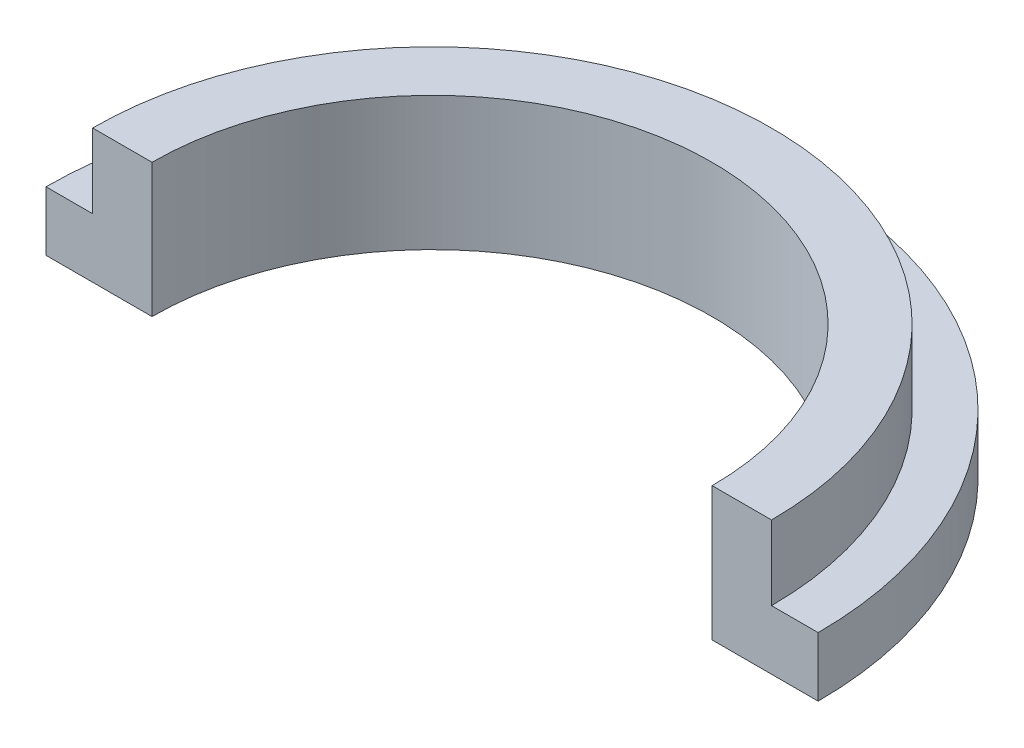
ISO-10303-21;
HEADER;
FILE_DESCRIPTION(('STEP AP214'),'2;1');
FILE_NAME('part.step','',(''),(''),'','','');
FILE_SCHEMA(('AUTOMOTIVE_DESIGN { 1 0 10303 214 1 1 1 1 }'));
ENDSEC;
DATA;
#1=APPLICATION_CONTEXT('core data for automotive mechanical design processes');
#2=APPLICATION_PROTOCOL_DEFINITION('international standard','automotive_design',2000,#1);
#3=PRODUCT_CONTEXT('',#1,'mechanical');
#4=PRODUCT('Part','Part','',(#3));
#5=PRODUCT_RELATED_PRODUCT_CATEGORY('part','',(#4));
#6=PRODUCT_DEFINITION_FORMATION('','',#4);
#7=PRODUCT_DEFINITION_CONTEXT('part definition',#1,'design');
#8=PRODUCT_DEFINITION('design','',#6,#7);
#9=PRODUCT_DEFINITION_SHAPE('','',#8);
#10=(LENGTH_UNIT() NAMED_UNIT(*) SI_UNIT(.MILLI.,.METRE.));
#11=(NAMED_UNIT(*) PLANE_ANGLE_UNIT() SI_UNIT($,.RADIAN.));
#12=(NAMED_UNIT(*) SI_UNIT($,.STERADIAN.) SOLID_ANGLE_UNIT());
#13=UNCERTAINTY_MEASURE_WITH_UNIT(LENGTH_MEASURE(1.E-05),#10,'distance_accuracy_value','');
#14=(GEOMETRIC_REPRESENTATION_CONTEXT(3) GLOBAL_UNCERTAINTY_ASSIGNED_CONTEXT((#13)) GLOBAL_UNIT_ASSIGNED_CONTEXT((#10,
#11,#12)) REPRESENTATION_CONTEXT('',''));
#15=CARTESIAN_POINT('',(0.,0.,0.));
#16=DIRECTION('',(0.,0.,1.));
#17=DIRECTION('',(1.,0.,0.));
#18=AXIS2_PLACEMENT_3D('',#15,#16,#17);
#19=CARTESIAN_POINT('',(0.,4.5,0.));
#20=DIRECTION('',(0.,-1.,0.));
#21=DIRECTION('',(0.,0.,-1.));
#22=AXIS2_PLACEMENT_3D('',#19,#20,#21);
#23=CYLINDRICAL_SURFACE('',#22,13.);
#24=CARTESIAN_POINT('',(0.,2.,0.));
#25=DIRECTION('',(0.,1.,0.));
#26=DIRECTION('',(0.,0.,1.));
#27=AXIS2_PLACEMENT_3D('',#24,#25,#26);
#28=CIRCLE('',#27,13.);
#29=CARTESIAN_POINT('',(13.,2.,0.));
#30=VERTEX_POINT('',#29);
#31=CARTESIAN_POINT('',(-13.,2.,0.));
#32=VERTEX_POINT('',#31);
#33=EDGE_CURVE('E126',#30,#32,#28,.T.);
#34=ORIENTED_EDGE('',*,*,#33,.F.);
#35=DIRECTION('',(0.,-1.,0.));
#36=VECTOR('',#35,1.);
#37=CARTESIAN_POINT('',(13.,4.5,0.));
#38=LINE('',#37,#36);
#39=CARTESIAN_POINT('',(13.,0.,0.));
#40=VERTEX_POINT('',#39);
#41=EDGE_CURVE('E48',#30,#40,#38,.T.);
#42=ORIENTED_EDGE('',*,*,#41,.T.);
#43=CARTESIAN_POINT('',(0.,0.,0.));
#44=DIRECTION('',(0.,1.,0.));
#45=DIRECTION('',(0.,0.,1.));
#46=AXIS2_PLACEMENT_3D('',#43,#44,#45);
#47=CIRCLE('',#46,13.);
#48=CARTESIAN_POINT('',(-13.,0.,0.));
#49=VERTEX_POINT('',#48);
#50=EDGE_CURVE('E96',#40,#49,#47,.T.);
#51=ORIENTED_EDGE('',*,*,#50,.T.);
#52=DIRECTION('',(0.,-1.,0.));
#53=VECTOR('',#52,1.);
#54=CARTESIAN_POINT('',(-13.,4.5,0.));
#55=LINE('',#54,#53);
#56=EDGE_CURVE('E89',#32,#49,#55,.T.);
#57=ORIENTED_EDGE('',*,*,#56,.F.);
#58=EDGE_LOOP('',(#34,#42,#51,#57));
#59=FACE_BOUND('',#58,.T.);
#60=ADVANCED_FACE('F39',(#59),#23,.T.);
#61=CARTESIAN_POINT('',(0.,4.5,0.));
#62=DIRECTION('',(0.,-1.,0.));
#63=DIRECTION('',(0.,0.,-1.));
#64=AXIS2_PLACEMENT_3D('',#61,#62,#63);
#65=CYLINDRICAL_SURFACE('',#64,9.43);
#66=CARTESIAN_POINT('',(0.,0.,0.));
#67=DIRECTION('',(0.,-1.,0.));
#68=DIRECTION('',(0.,0.,1.));
#69=AXIS2_PLACEMENT_3D('',#66,#67,#68);
#70=CIRCLE('',#69,9.43);
#71=CARTESIAN_POINT('',(-9.43,0.,0.));
#72=VERTEX_POINT('',#71);
#73=CARTESIAN_POINT('',(9.43,0.,0.));
#74=VERTEX_POINT('',#73);
#75=EDGE_CURVE('E101',#72,#74,#70,.T.);
#76=ORIENTED_EDGE('',*,*,#75,.T.);
#77=DIRECTION('',(0.,-1.,0.));
#78=VECTOR('',#77,1.);
#79=CARTESIAN_POINT('',(9.43,4.5,0.));
#80=LINE('',#79,#78);
#81=CARTESIAN_POINT('',(9.43,4.5,0.));
#82=VERTEX_POINT('',#81);
#83=EDGE_CURVE('E11',#82,#74,#80,.T.);
#84=ORIENTED_EDGE('',*,*,#83,.F.);
#85=CARTESIAN_POINT('',(0.,4.5,0.));
#86=DIRECTION('',(0.,-1.,0.));
#87=DIRECTION('',(0.,0.,1.));
#88=AXIS2_PLACEMENT_3D('',#85,#86,#87);
#89=CIRCLE('',#88,9.43);
#90=CARTESIAN_POINT('',(-9.43,4.5,0.));
#91=VERTEX_POINT('',#90);
#92=EDGE_CURVE('E95',#91,#82,#89,.T.);
#93=ORIENTED_EDGE('',*,*,#92,.F.);
#94=DIRECTION('',(0.,-1.,0.));
#95=VECTOR('',#94,1.);
#96=CARTESIAN_POINT('',(-9.43,4.5,0.));
#97=LINE('',#96,#95);
#98=EDGE_CURVE('E85',#91,#72,#97,.T.);
#99=ORIENTED_EDGE('',*,*,#98,.T.);
#100=EDGE_LOOP('',(#76,#84,#93,#99));
#101=FACE_BOUND('',#100,.T.);
#102=ADVANCED_FACE('F41',(#101),#65,.F.);
#103=CARTESIAN_POINT('',(9.43,4.5,0.));
#104=DIRECTION('',(0.,0.,-1.));
#105=DIRECTION('',(-1.,0.,0.));
#106=AXIS2_PLACEMENT_3D('',#103,#104,#105);
#107=PLANE('',#106);
#108=DIRECTION('',(1.,0.,0.));
#109=VECTOR('',#108,1.);
#110=CARTESIAN_POINT('',(11.43,2.,0.));
#111=LINE('',#110,#109);
#112=CARTESIAN_POINT('',(11.43,2.,0.));
#113=VERTEX_POINT('',#112);
#114=EDGE_CURVE('E140',#113,#30,#111,.T.);
#115=ORIENTED_EDGE('',*,*,#114,.F.);
#116=DIRECTION('',(0.,1.,0.));
#117=VECTOR('',#116,1.);
#118=CARTESIAN_POINT('',(11.43,2.,0.));
#119=LINE('',#118,#117);
#120=CARTESIAN_POINT('',(11.43,4.5,0.));
#121=VERTEX_POINT('',#120);
#122=EDGE_CURVE('E108',#113,#121,#119,.T.);
#123=ORIENTED_EDGE('',*,*,#122,.T.);
#124=DIRECTION('',(1.,0.,0.));
#125=VECTOR('',#124,1.);
#126=CARTESIAN_POINT('',(9.43,4.5,0.));
#127=LINE('',#126,#125);
#128=EDGE_CURVE('E131',#82,#121,#127,.T.);
#129=ORIENTED_EDGE('',*,*,#128,.F.);
#130=ORIENTED_EDGE('',*,*,#83,.T.);
#131=DIRECTION('',(1.,0.,0.));
#132=VECTOR('',#131,1.);
#133=CARTESIAN_POINT('',(9.43,0.,0.));
#134=LINE('',#133,#132);
#135=EDGE_CURVE('E106',#74,#40,#134,.T.);
#136=ORIENTED_EDGE('',*,*,#135,.T.);
#137=ORIENTED_EDGE('',*,*,#41,.F.);
#138=EDGE_LOOP('',(#115,#123,#129,#130,#136,#137));
#139=FACE_BOUND('',#138,.T.);
#140=ADVANCED_FACE('F129',(#139),#107,.F.);
#141=CARTESIAN_POINT('',(-13.,4.5,0.));
#142=DIRECTION('',(0.,0.,-1.));
#143=DIRECTION('',(-1.,0.,0.));
#144=AXIS2_PLACEMENT_3D('',#141,#142,#143);
#145=PLANE('',#144);
#146=DIRECTION('',(1.,0.,0.));
#147=VECTOR('',#146,1.);
#148=CARTESIAN_POINT('',(-13.,4.5,0.));
#149=LINE('',#148,#147);
#150=CARTESIAN_POINT('',(-11.43,4.5,0.));
#151=VERTEX_POINT('',#150);
#152=EDGE_CURVE('E63',#151,#91,#149,.T.);
#153=ORIENTED_EDGE('',*,*,#152,.F.);
#154=DIRECTION('',(0.,1.,0.));
#155=VECTOR('',#154,1.);
#156=CARTESIAN_POINT('',(-11.43,2.,0.));
#157=LINE('',#156,#155);
#158=CARTESIAN_POINT('',(-11.43,2.,0.));
#159=VERTEX_POINT('',#158);
#160=EDGE_CURVE('E55',#159,#151,#157,.T.);
#161=ORIENTED_EDGE('',*,*,#160,.F.);
#162=DIRECTION('',(1.,0.,0.));
#163=VECTOR('',#162,1.);
#164=CARTESIAN_POINT('',(-13.,2.,0.));
#165=LINE('',#164,#163);
#166=EDGE_CURVE('E152',#32,#159,#165,.T.);
#167=ORIENTED_EDGE('',*,*,#166,.F.);
#168=ORIENTED_EDGE('',*,*,#56,.T.);
#169=DIRECTION('',(1.,0.,0.));
#170=VECTOR('',#169,1.);
#171=CARTESIAN_POINT('',(-13.,0.,0.));
#172=LINE('',#171,#170);
#173=EDGE_CURVE('E82',#49,#72,#172,.T.);
#174=ORIENTED_EDGE('',*,*,#173,.T.);
#175=ORIENTED_EDGE('',*,*,#98,.F.);
#176=EDGE_LOOP('',(#153,#161,#167,#168,#174,#175));
#177=FACE_BOUND('',#176,.T.);
#178=ADVANCED_FACE('F84',(#177),#145,.F.);
#179=CARTESIAN_POINT('',(0.,4.5,0.));
#180=DIRECTION('',(0.,1.,0.));
#181=DIRECTION('',(0.,0.,1.));
#182=AXIS2_PLACEMENT_3D('',#179,#180,#181);
#183=PLANE('',#182);
#184=CARTESIAN_POINT('',(0.,4.5,0.));
#185=DIRECTION('',(0.,-1.,0.));
#186=DIRECTION('',(0.,0.,1.));
#187=AXIS2_PLACEMENT_3D('',#184,#185,#186);
#188=CIRCLE('',#187,11.43);
#189=EDGE_CURVE('E142',#151,#121,#188,.T.);
#190=ORIENTED_EDGE('',*,*,#189,.F.);
#191=ORIENTED_EDGE('',*,*,#152,.T.);
#192=ORIENTED_EDGE('',*,*,#92,.T.);
#193=ORIENTED_EDGE('',*,*,#128,.T.);
#194=EDGE_LOOP('',(#190,#191,#192,#193));
#195=FACE_BOUND('',#194,.T.);
#196=ADVANCED_FACE('F135',(#195),#183,.T.);
#197=CARTESIAN_POINT('',(0.,0.,0.));
#198=DIRECTION('',(0.,1.,0.));
#199=DIRECTION('',(0.,0.,1.));
#200=AXIS2_PLACEMENT_3D('',#197,#198,#199);
#201=PLANE('',#200);
#202=ORIENTED_EDGE('',*,*,#75,.F.);
#203=ORIENTED_EDGE('',*,*,#173,.F.);
#204=ORIENTED_EDGE('',*,*,#50,.F.);
#205=ORIENTED_EDGE('',*,*,#135,.F.);
#206=EDGE_LOOP('',(#202,#203,#204,#205));
#207=FACE_BOUND('',#206,.T.);
#208=ADVANCED_FACE('F104',(#207),#201,.F.);
#209=CARTESIAN_POINT('',(0.,2.,0.));
#210=DIRECTION('',(0.,1.,0.));
#211=DIRECTION('',(0.,0.,1.));
#212=AXIS2_PLACEMENT_3D('',#209,#210,#211);
#213=CYLINDRICAL_SURFACE('',#212,11.43);
#214=ORIENTED_EDGE('',*,*,#189,.T.);
#215=ORIENTED_EDGE('',*,*,#122,.F.);
#216=CARTESIAN_POINT('',(0.,2.,0.));
#217=DIRECTION('',(0.,-1.,0.));
#218=DIRECTION('',(0.,0.,1.));
#219=AXIS2_PLACEMENT_3D('',#216,#217,#218);
#220=CIRCLE('',#219,11.43);
#221=EDGE_CURVE('E148',#159,#113,#220,.T.);
#222=ORIENTED_EDGE('',*,*,#221,.F.);
#223=ORIENTED_EDGE('',*,*,#160,.T.);
#224=EDGE_LOOP('',(#214,#215,#222,#223));
#225=FACE_BOUND('',#224,.T.);
#226=ADVANCED_FACE('F166',(#225),#213,.T.);
#227=CARTESIAN_POINT('',(0.,2.,0.));
#228=DIRECTION('',(0.,1.,0.));
#229=DIRECTION('',(0.,0.,1.));
#230=AXIS2_PLACEMENT_3D('',#227,#228,#229);
#231=PLANE('',#230);
#232=ORIENTED_EDGE('',*,*,#33,.T.);
#233=ORIENTED_EDGE('',*,*,#166,.T.);
#234=ORIENTED_EDGE('',*,*,#221,.T.);
#235=ORIENTED_EDGE('',*,*,#114,.T.);
#236=EDGE_LOOP('',(#232,#233,#234,#235));
#237=FACE_BOUND('',#236,.T.);
#238=ADVANCED_FACE('F159',(#237),#231,.T.);
#239=CLOSED_SHELL('',(#60,#102,#140,#178,#196,#208,#226,#238));
#240=MANIFOLD_SOLID_BREP('B2',#239);
#241=ADVANCED_BREP_SHAPE_REPRESENTATION('',(#18,#240),#14);
#242=SHAPE_DEFINITION_REPRESENTATION(#9,#241);
ENDSEC;
END-ISO-10303-21;
